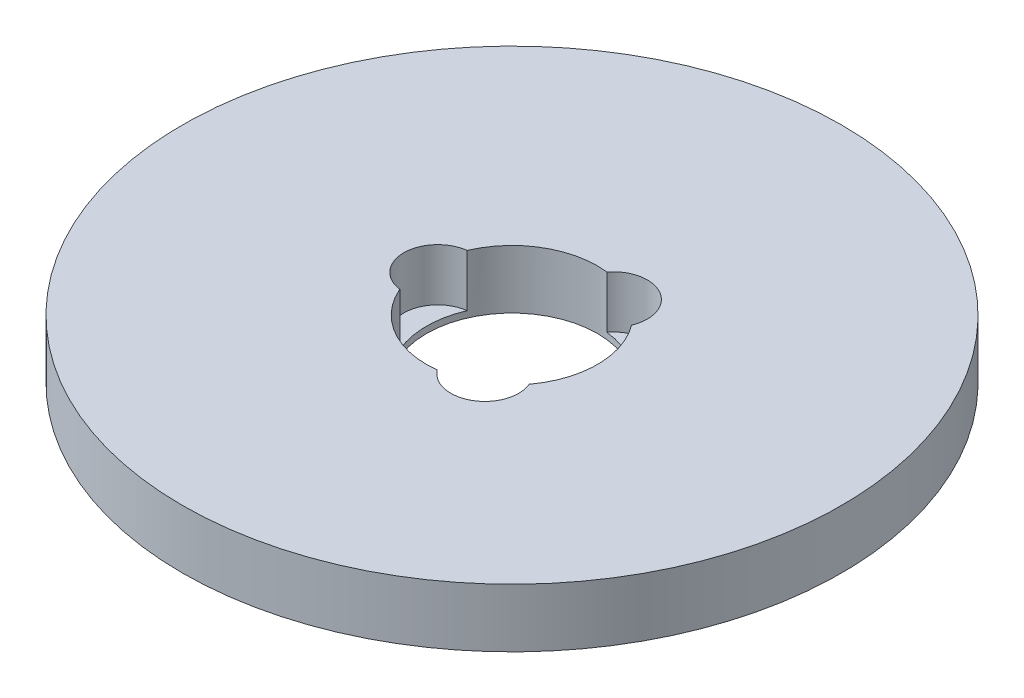
ISO-10303-21;
HEADER;
FILE_DESCRIPTION(('STEP AP214'),'2;1');
FILE_NAME('part.step','',(''),(''),'','','');
FILE_SCHEMA(('AUTOMOTIVE_DESIGN { 1 0 10303 214 1 1 1 1 }'));
ENDSEC;
DATA;
#1=APPLICATION_CONTEXT('core data for automotive mechanical design processes');
#2=APPLICATION_PROTOCOL_DEFINITION('international standard','automotive_design',2000,#1);
#3=PRODUCT_CONTEXT('',#1,'mechanical');
#4=PRODUCT('Part','Part','',(#3));
#5=PRODUCT_RELATED_PRODUCT_CATEGORY('part','',(#4));
#6=PRODUCT_DEFINITION_FORMATION('','',#4);
#7=PRODUCT_DEFINITION_CONTEXT('part definition',#1,'design');
#8=PRODUCT_DEFINITION('design','',#6,#7);
#9=PRODUCT_DEFINITION_SHAPE('','',#8);
#10=(LENGTH_UNIT() NAMED_UNIT(*) SI_UNIT(.MILLI.,.METRE.));
#11=(NAMED_UNIT(*) PLANE_ANGLE_UNIT() SI_UNIT($,.RADIAN.));
#12=(NAMED_UNIT(*) SI_UNIT($,.STERADIAN.) SOLID_ANGLE_UNIT());
#13=UNCERTAINTY_MEASURE_WITH_UNIT(LENGTH_MEASURE(1.E-05),#10,'distance_accuracy_value','');
#14=(GEOMETRIC_REPRESENTATION_CONTEXT(3) GLOBAL_UNCERTAINTY_ASSIGNED_CONTEXT((#13)) GLOBAL_UNIT_ASSIGNED_CONTEXT((#10,
#11,#12)) REPRESENTATION_CONTEXT('',''));
#15=CARTESIAN_POINT('',(0.,0.,0.));
#16=DIRECTION('',(0.,0.,1.));
#17=DIRECTION('',(1.,0.,0.));
#18=AXIS2_PLACEMENT_3D('',#15,#16,#17);
#19=CARTESIAN_POINT('',(0.,12.,0.));
#20=DIRECTION('',(0.,-1.,0.));
#21=DIRECTION('',(0.,0.,-1.));
#22=AXIS2_PLACEMENT_3D('',#19,#20,#21);
#23=CYLINDRICAL_SURFACE('',#22,67.5);
#24=CARTESIAN_POINT('',(0.,12.,0.));
#25=DIRECTION('',(0.,1.,0.));
#26=DIRECTION('',(0.,0.,1.));
#27=AXIS2_PLACEMENT_3D('',#24,#25,#26);
#28=CIRCLE('',#27,67.5);
#29=CARTESIAN_POINT('',(0.,12.,67.5));
#30=VERTEX_POINT('',#29);
#31=EDGE_CURVE('E130',#30,#30,#28,.T.);
#32=ORIENTED_EDGE('',*,*,#31,.F.);
#33=EDGE_LOOP('',(#32));
#34=FACE_BOUND('',#33,.T.);
#35=CARTESIAN_POINT('',(0.,0.,0.));
#36=DIRECTION('',(0.,1.,0.));
#37=DIRECTION('',(0.,0.,1.));
#38=AXIS2_PLACEMENT_3D('',#35,#36,#37);
#39=CIRCLE('',#38,67.5);
#40=CARTESIAN_POINT('',(0.,0.,67.5));
#41=VERTEX_POINT('',#40);
#42=EDGE_CURVE('E117',#41,#41,#39,.T.);
#43=ORIENTED_EDGE('',*,*,#42,.T.);
#44=EDGE_LOOP('',(#43));
#45=FACE_BOUND('',#44,.T.);
#46=ADVANCED_FACE('F39',(#34,#45),#23,.T.);
#47=CARTESIAN_POINT('',(0.,12.,0.));
#48=DIRECTION('',(0.,1.,0.));
#49=DIRECTION('',(0.,0.,1.));
#50=AXIS2_PLACEMENT_3D('',#47,#48,#49);
#51=PLANE('',#50);
#52=CARTESIAN_POINT('',(7.60272454281568,12.,13.1683051841075));
#53=DIRECTION('',(0.,1.,0.));
#54=DIRECTION('',(0.866025403784436,0.,-0.500000000000004));
#55=AXIS2_PLACEMENT_3D('',#52,#53,#54);
#56=CIRCLE('',#55,6.95449544444965);
#57=CARTESIAN_POINT('',(2.0667151891361,12.,17.3775340116771));
#58=VERTEX_POINT('',#57);
#59=CARTESIAN_POINT('',(14.0160283146725,12.,10.4785948620174));
#60=VERTEX_POINT('',#59);
#61=EDGE_CURVE('E148',#58,#60,#56,.T.);
#62=ORIENTED_EDGE('',*,*,#61,.F.);
#63=CARTESIAN_POINT('',(0.,12.,0.));
#64=DIRECTION('',(0.,1.,0.));
#65=DIRECTION('',(0.,0.,1.));
#66=AXIS2_PLACEMENT_3D('',#63,#64,#65);
#67=CIRCLE('',#66,17.5);
#68=CARTESIAN_POINT('',(-16.0827435038085,12.,6.8989391496596));
#69=VERTEX_POINT('',#68);
#70=EDGE_CURVE('E113',#69,#58,#67,.T.);
#71=ORIENTED_EDGE('',*,*,#70,.F.);
#72=CARTESIAN_POINT('',(-15.2054490856312,12.,0.));
#73=DIRECTION('',(0.,1.,0.));
#74=DIRECTION('',(0.,0.,1.));
#75=AXIS2_PLACEMENT_3D('',#72,#73,#74);
#76=CIRCLE('',#75,6.95449544444965);
#77=CARTESIAN_POINT('',(-16.0827435038085,12.,-6.8989391496596));
#78=VERTEX_POINT('',#77);
#79=EDGE_CURVE('E125',#78,#69,#76,.T.);
#80=ORIENTED_EDGE('',*,*,#79,.F.);
#81=CARTESIAN_POINT('',(2.06671518913586,12.,-17.3775340116771));
#82=VERTEX_POINT('',#81);
#83=EDGE_CURVE('E107',#82,#78,#67,.T.);
#84=ORIENTED_EDGE('',*,*,#83,.F.);
#85=CARTESIAN_POINT('',(7.60272454281549,12.,-13.1683051841076));
#86=DIRECTION('',(0.,1.,0.));
#87=DIRECTION('',(-0.866025403784443,0.,-0.499999999999992));
#88=AXIS2_PLACEMENT_3D('',#85,#86,#87);
#89=CIRCLE('',#88,6.95449544444965);
#90=CARTESIAN_POINT('',(14.0160283146724,12.,-10.4785948620176));
#91=VERTEX_POINT('',#90);
#92=EDGE_CURVE('E95',#91,#82,#89,.T.);
#93=ORIENTED_EDGE('',*,*,#92,.F.);
#94=EDGE_CURVE('E106',#60,#91,#67,.T.);
#95=ORIENTED_EDGE('',*,*,#94,.F.);
#96=EDGE_LOOP('',(#62,#71,#80,#84,#93,#95));
#97=FACE_BOUND('',#96,.T.);
#98=ORIENTED_EDGE('',*,*,#31,.T.);
#99=EDGE_LOOP('',(#98));
#100=FACE_BOUND('',#99,.T.);
#101=ADVANCED_FACE('F102',(#97,#100),#51,.T.);
#102=CARTESIAN_POINT('',(0.,0.,0.));
#103=DIRECTION('',(0.,1.,0.));
#104=DIRECTION('',(0.,0.,1.));
#105=AXIS2_PLACEMENT_3D('',#102,#103,#104);
#106=PLANE('',#105);
#107=CARTESIAN_POINT('',(0.,0.,0.));
#108=DIRECTION('',(0.,1.,0.));
#109=DIRECTION('',(0.,0.,1.));
#110=AXIS2_PLACEMENT_3D('',#107,#108,#109);
#111=CIRCLE('',#110,17.5);
#112=CARTESIAN_POINT('',(0.,0.,17.5));
#113=VERTEX_POINT('',#112);
#114=EDGE_CURVE('E118',#113,#113,#111,.T.);
#115=ORIENTED_EDGE('',*,*,#114,.T.);
#116=EDGE_LOOP('',(#115));
#117=FACE_BOUND('',#116,.T.);
#118=ORIENTED_EDGE('',*,*,#42,.F.);
#119=EDGE_LOOP('',(#118));
#120=FACE_BOUND('',#119,.T.);
#121=ADVANCED_FACE('F161',(#117,#120),#106,.F.);
#122=CARTESIAN_POINT('',(0.,12.,0.));
#123=DIRECTION('',(0.,-1.,0.));
#124=DIRECTION('',(0.,0.,-1.));
#125=AXIS2_PLACEMENT_3D('',#122,#123,#124);
#126=CYLINDRICAL_SURFACE('',#125,17.5);
#127=DIRECTION('',(0.,1.,0.));
#128=VECTOR('',#127,1.);
#129=CARTESIAN_POINT('',(2.0667151891361,6.65633361559976,17.3775340116771));
#130=LINE('',#129,#128);
#131=CARTESIAN_POINT('',(2.0667151891361,1.31266723119953,17.3775340116771));
#132=VERTEX_POINT('',#131);
#133=EDGE_CURVE('E11',#132,#58,#130,.T.);
#134=ORIENTED_EDGE('',*,*,#133,.F.);
#135=CARTESIAN_POINT('',(0.,1.31266723119953,0.));
#136=DIRECTION('',(0.,1.,0.));
#137=DIRECTION('',(0.,0.,1.));
#138=AXIS2_PLACEMENT_3D('',#135,#136,#137);
#139=CIRCLE('',#138,17.5);
#140=CARTESIAN_POINT('',(14.0160283146725,1.31266723119953,10.4785948620174));
#141=VERTEX_POINT('',#140);
#142=EDGE_CURVE('E100',#132,#141,#139,.T.);
#143=ORIENTED_EDGE('',*,*,#142,.T.);
#144=DIRECTION('',(0.,1.,0.));
#145=VECTOR('',#144,1.);
#146=CARTESIAN_POINT('',(14.0160283146725,6.65633361559976,10.4785948620174));
#147=LINE('',#146,#145);
#148=EDGE_CURVE('E46',#60,#141,#147,.F.);
#149=ORIENTED_EDGE('',*,*,#148,.F.);
#150=ORIENTED_EDGE('',*,*,#94,.T.);
#151=DIRECTION('',(0.,1.,0.));
#152=VECTOR('',#151,1.);
#153=CARTESIAN_POINT('',(14.0160283146724,6.65633361559976,-10.4785948620176));
#154=LINE('',#153,#152);
#155=CARTESIAN_POINT('',(14.0160283146724,1.31266723119953,-10.4785948620176));
#156=VERTEX_POINT('',#155);
#157=EDGE_CURVE('E90',#156,#91,#154,.T.);
#158=ORIENTED_EDGE('',*,*,#157,.F.);
#159=CARTESIAN_POINT('',(0.,1.31266723119953,0.));
#160=DIRECTION('',(0.,1.,0.));
#161=DIRECTION('',(0.,0.,1.));
#162=AXIS2_PLACEMENT_3D('',#159,#160,#161);
#163=CIRCLE('',#162,17.5);
#164=CARTESIAN_POINT('',(2.06671518913586,1.31266723119953,-17.3775340116771));
#165=VERTEX_POINT('',#164);
#166=EDGE_CURVE('E143',#156,#165,#163,.T.);
#167=ORIENTED_EDGE('',*,*,#166,.T.);
#168=DIRECTION('',(0.,1.,0.));
#169=VECTOR('',#168,1.);
#170=CARTESIAN_POINT('',(2.06671518913586,6.65633361559976,-17.3775340116771));
#171=LINE('',#170,#169);
#172=EDGE_CURVE('E98',#82,#165,#171,.F.);
#173=ORIENTED_EDGE('',*,*,#172,.F.);
#174=ORIENTED_EDGE('',*,*,#83,.T.);
#175=DIRECTION('',(0.,1.,0.));
#176=VECTOR('',#175,1.);
#177=CARTESIAN_POINT('',(-16.0827435038085,6.65633361559976,-6.8989391496596));
#178=LINE('',#177,#176);
#179=CARTESIAN_POINT('',(-16.0827435038085,1.31266723119953,-6.8989391496596));
#180=VERTEX_POINT('',#179);
#181=EDGE_CURVE('E137',#180,#78,#178,.T.);
#182=ORIENTED_EDGE('',*,*,#181,.F.);
#183=CARTESIAN_POINT('',(0.,1.31266723119953,0.));
#184=DIRECTION('',(0.,1.,0.));
#185=DIRECTION('',(0.,0.,1.));
#186=AXIS2_PLACEMENT_3D('',#183,#184,#185);
#187=CIRCLE('',#186,17.5);
#188=CARTESIAN_POINT('',(-16.0827435038085,1.31266723119953,6.8989391496596));
#189=VERTEX_POINT('',#188);
#190=EDGE_CURVE('E128',#180,#189,#187,.T.);
#191=ORIENTED_EDGE('',*,*,#190,.T.);
#192=DIRECTION('',(0.,1.,0.));
#193=VECTOR('',#192,1.);
#194=CARTESIAN_POINT('',(-16.0827435038085,6.65633361559976,6.8989391496596));
#195=LINE('',#194,#193);
#196=EDGE_CURVE('E134',#69,#189,#195,.F.);
#197=ORIENTED_EDGE('',*,*,#196,.F.);
#198=ORIENTED_EDGE('',*,*,#70,.T.);
#199=EDGE_LOOP('',(#134,#143,#149,#150,#158,#167,#173,#174,#182,#191,#197,#198));
#200=FACE_BOUND('',#199,.T.);
#201=ORIENTED_EDGE('',*,*,#114,.F.);
#202=EDGE_LOOP('',(#201));
#203=FACE_BOUND('',#202,.T.);
#204=ADVANCED_FACE('F115',(#200,#203),#126,.F.);
#205=CARTESIAN_POINT('',(-15.2054490856312,1.31266723119953,0.));
#206=DIRECTION('',(0.,1.,0.));
#207=DIRECTION('',(0.,0.,1.));
#208=AXIS2_PLACEMENT_3D('',#205,#206,#207);
#209=CYLINDRICAL_SURFACE('',#208,6.95449544444965);
#210=ORIENTED_EDGE('',*,*,#181,.T.);
#211=ORIENTED_EDGE('',*,*,#79,.T.);
#212=ORIENTED_EDGE('',*,*,#196,.T.);
#213=CARTESIAN_POINT('',(-15.2054490856312,1.31266723119953,0.));
#214=DIRECTION('',(0.,1.,0.));
#215=DIRECTION('',(0.,0.,1.));
#216=AXIS2_PLACEMENT_3D('',#213,#214,#215);
#217=CIRCLE('',#216,6.95449544444965);
#218=EDGE_CURVE('E127',#180,#189,#217,.T.);
#219=ORIENTED_EDGE('',*,*,#218,.F.);
#220=EDGE_LOOP('',(#210,#211,#212,#219));
#221=FACE_BOUND('',#220,.T.);
#222=ADVANCED_FACE('F175',(#221),#209,.F.);
#223=CARTESIAN_POINT('',(-15.2054490856312,1.31266723119953,0.));
#224=DIRECTION('',(0.,1.,0.));
#225=DIRECTION('',(0.,0.,1.));
#226=AXIS2_PLACEMENT_3D('',#223,#224,#225);
#227=PLANE('',#226);
#228=ORIENTED_EDGE('',*,*,#218,.T.);
#229=ORIENTED_EDGE('',*,*,#190,.F.);
#230=EDGE_LOOP('',(#228,#229));
#231=FACE_BOUND('',#230,.T.);
#232=ADVANCED_FACE('F176',(#231),#227,.T.);
#233=CARTESIAN_POINT('',(7.60272454281549,1.31266723119953,-13.1683051841076));
#234=DIRECTION('',(0.,1.,0.));
#235=DIRECTION('',(0.,0.,1.));
#236=AXIS2_PLACEMENT_3D('',#233,#234,#235);
#237=CYLINDRICAL_SURFACE('',#236,6.95449544444965);
#238=ORIENTED_EDGE('',*,*,#157,.T.);
#239=ORIENTED_EDGE('',*,*,#92,.T.);
#240=ORIENTED_EDGE('',*,*,#172,.T.);
#241=CARTESIAN_POINT('',(7.60272454281549,1.31266723119953,-13.1683051841076));
#242=DIRECTION('',(0.,1.,0.));
#243=DIRECTION('',(-0.866025403784443,0.,-0.499999999999992));
#244=AXIS2_PLACEMENT_3D('',#241,#242,#243);
#245=CIRCLE('',#244,6.95449544444965);
#246=EDGE_CURVE('E56',#156,#165,#245,.T.);
#247=ORIENTED_EDGE('',*,*,#246,.F.);
#248=EDGE_LOOP('',(#238,#239,#240,#247));
#249=FACE_BOUND('',#248,.T.);
#250=ADVANCED_FACE('F93',(#249),#237,.F.);
#251=CARTESIAN_POINT('',(7.60272454281549,1.31266723119953,-13.1683051841076));
#252=DIRECTION('',(0.,1.,0.));
#253=DIRECTION('',(-0.866025403784443,0.,-0.499999999999992));
#254=AXIS2_PLACEMENT_3D('',#251,#252,#253);
#255=PLANE('',#254);
#256=ORIENTED_EDGE('',*,*,#246,.T.);
#257=ORIENTED_EDGE('',*,*,#166,.F.);
#258=EDGE_LOOP('',(#256,#257));
#259=FACE_BOUND('',#258,.T.);
#260=ADVANCED_FACE('F153',(#259),#255,.T.);
#261=CARTESIAN_POINT('',(7.60272454281568,1.31266723119953,13.1683051841075));
#262=DIRECTION('',(0.,1.,0.));
#263=DIRECTION('',(0.,0.,1.));
#264=AXIS2_PLACEMENT_3D('',#261,#262,#263);
#265=CYLINDRICAL_SURFACE('',#264,6.95449544444965);
#266=ORIENTED_EDGE('',*,*,#133,.T.);
#267=ORIENTED_EDGE('',*,*,#61,.T.);
#268=ORIENTED_EDGE('',*,*,#148,.T.);
#269=CARTESIAN_POINT('',(7.60272454281568,1.31266723119953,13.1683051841075));
#270=DIRECTION('',(0.,1.,0.));
#271=DIRECTION('',(0.866025403784436,0.,-0.500000000000004));
#272=AXIS2_PLACEMENT_3D('',#269,#270,#271);
#273=CIRCLE('',#272,6.95449544444965);
#274=EDGE_CURVE('E55',#132,#141,#273,.T.);
#275=ORIENTED_EDGE('',*,*,#274,.F.);
#276=EDGE_LOOP('',(#266,#267,#268,#275));
#277=FACE_BOUND('',#276,.T.);
#278=ADVANCED_FACE('F144',(#277),#265,.F.);
#279=CARTESIAN_POINT('',(7.60272454281568,1.31266723119953,13.1683051841075));
#280=DIRECTION('',(0.,1.,0.));
#281=DIRECTION('',(0.866025403784436,0.,-0.500000000000004));
#282=AXIS2_PLACEMENT_3D('',#279,#280,#281);
#283=PLANE('',#282);
#284=ORIENTED_EDGE('',*,*,#274,.T.);
#285=ORIENTED_EDGE('',*,*,#142,.F.);
#286=EDGE_LOOP('',(#284,#285));
#287=FACE_BOUND('',#286,.T.);
#288=ADVANCED_FACE('F150',(#287),#283,.T.);
#289=CLOSED_SHELL('',(#46,#101,#121,#204,#222,#232,#250,#260,#278,#288));
#290=MANIFOLD_SOLID_BREP('B2',#289);
#291=ADVANCED_BREP_SHAPE_REPRESENTATION('',(#18,#290),#14);
#292=SHAPE_DEFINITION_REPRESENTATION(#9,#291);
ENDSEC;
END-ISO-10303-21;
